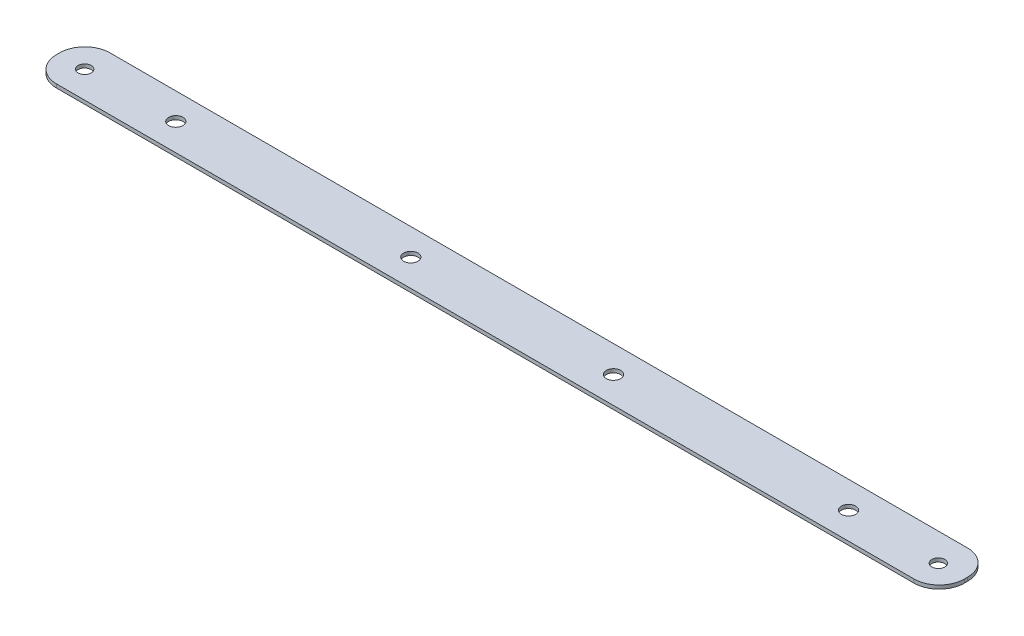
ISO-10303-21;
HEADER;
FILE_DESCRIPTION(('STEP AP214'),'2;1');
FILE_NAME('part.step','',(''),(''),'','','');
FILE_SCHEMA(('AUTOMOTIVE_DESIGN { 1 0 10303 214 1 1 1 1 }'));
ENDSEC;
DATA;
#1=APPLICATION_CONTEXT('core data for automotive mechanical design processes');
#2=APPLICATION_PROTOCOL_DEFINITION('international standard','automotive_design',2000,#1);
#3=PRODUCT_CONTEXT('',#1,'mechanical');
#4=PRODUCT('Part','Part','',(#3));
#5=PRODUCT_RELATED_PRODUCT_CATEGORY('part','',(#4));
#6=PRODUCT_DEFINITION_FORMATION('','',#4);
#7=PRODUCT_DEFINITION_CONTEXT('part definition',#1,'design');
#8=PRODUCT_DEFINITION('design','',#6,#7);
#9=PRODUCT_DEFINITION_SHAPE('','',#8);
#10=(LENGTH_UNIT() NAMED_UNIT(*) SI_UNIT(.MILLI.,.METRE.));
#11=(NAMED_UNIT(*) PLANE_ANGLE_UNIT() SI_UNIT($,.RADIAN.));
#12=(NAMED_UNIT(*) SI_UNIT($,.STERADIAN.) SOLID_ANGLE_UNIT());
#13=UNCERTAINTY_MEASURE_WITH_UNIT(LENGTH_MEASURE(1.E-05),#10,'distance_accuracy_value','');
#14=(GEOMETRIC_REPRESENTATION_CONTEXT(3) GLOBAL_UNCERTAINTY_ASSIGNED_CONTEXT((#13)) GLOBAL_UNIT_ASSIGNED_CONTEXT((#10,
#11,#12)) REPRESENTATION_CONTEXT('',''));
#15=CARTESIAN_POINT('',(0.,0.,0.));
#16=DIRECTION('',(0.,0.,1.));
#17=DIRECTION('',(1.,0.,0.));
#18=AXIS2_PLACEMENT_3D('',#15,#16,#17);
#19=CARTESIAN_POINT('',(-107.95,-0.86,6.37500000000002));
#20=DIRECTION('',(-1.,0.,0.));
#21=DIRECTION('',(0.,0.,1.));
#22=AXIS2_PLACEMENT_3D('',#19,#20,#21);
#23=PLANE('',#22);
#24=DIRECTION('',(0.,0.,1.));
#25=VECTOR('',#24,1.);
#26=CARTESIAN_POINT('',(-107.95,0.,6.37500000000002));
#27=LINE('',#26,#25);
#28=CARTESIAN_POINT('',(-107.95,0.,-0.374999999999985));
#29=VERTEX_POINT('',#28);
#30=CARTESIAN_POINT('',(-107.95,0.,0.375000000000012));
#31=VERTEX_POINT('',#30);
#32=EDGE_CURVE('E107',#29,#31,#27,.T.);
#33=ORIENTED_EDGE('',*,*,#32,.F.);
#34=DIRECTION('',(0.,1.,0.));
#35=VECTOR('',#34,1.);
#36=CARTESIAN_POINT('',(-107.95,-0.86,-0.374999999999985));
#37=LINE('',#36,#35);
#38=CARTESIAN_POINT('',(-107.95,-0.86,-0.374999999999985));
#39=VERTEX_POINT('',#38);
#40=EDGE_CURVE('E11',#29,#39,#37,.F.);
#41=ORIENTED_EDGE('',*,*,#40,.T.);
#42=DIRECTION('',(0.,0.,1.));
#43=VECTOR('',#42,1.);
#44=CARTESIAN_POINT('',(-107.95,-0.86,6.37500000000002));
#45=LINE('',#44,#43);
#46=CARTESIAN_POINT('',(-107.95,-0.86,0.375000000000012));
#47=VERTEX_POINT('',#46);
#48=EDGE_CURVE('E157',#39,#47,#45,.T.);
#49=ORIENTED_EDGE('',*,*,#48,.T.);
#50=DIRECTION('',(0.,1.,0.));
#51=VECTOR('',#50,1.);
#52=CARTESIAN_POINT('',(-107.95,-0.86,0.375000000000012));
#53=LINE('',#52,#51);
#54=EDGE_CURVE('E44',#47,#31,#53,.T.);
#55=ORIENTED_EDGE('',*,*,#54,.T.);
#56=EDGE_LOOP('',(#33,#41,#49,#55));
#57=FACE_BOUND('',#56,.T.);
#58=ADVANCED_FACE('F36',(#57),#23,.T.);
#59=CARTESIAN_POINT('',(107.95,-0.86,-6.37500000000001));
#60=DIRECTION('',(0.,0.,-1.));
#61=DIRECTION('',(-1.,0.,0.));
#62=AXIS2_PLACEMENT_3D('',#59,#60,#61);
#63=PLANE('',#62);
#64=DIRECTION('',(-1.,0.,0.));
#65=VECTOR('',#64,1.);
#66=CARTESIAN_POINT('',(107.95,0.,-6.37500000000001));
#67=LINE('',#66,#65);
#68=CARTESIAN_POINT('',(101.95,0.,-6.375));
#69=VERTEX_POINT('',#68);
#70=CARTESIAN_POINT('',(-101.95,0.,-6.37499999999998));
#71=VERTEX_POINT('',#70);
#72=EDGE_CURVE('E132',#69,#71,#67,.T.);
#73=ORIENTED_EDGE('',*,*,#72,.F.);
#74=DIRECTION('',(0.,1.,0.));
#75=VECTOR('',#74,1.);
#76=CARTESIAN_POINT('',(101.95,-0.86,-6.375));
#77=LINE('',#76,#75);
#78=CARTESIAN_POINT('',(101.95,-0.86,-6.375));
#79=VERTEX_POINT('',#78);
#80=EDGE_CURVE('E58',#69,#79,#77,.F.);
#81=ORIENTED_EDGE('',*,*,#80,.T.);
#82=DIRECTION('',(-1.,0.,0.));
#83=VECTOR('',#82,1.);
#84=CARTESIAN_POINT('',(107.95,-0.86,-6.37500000000001));
#85=LINE('',#84,#83);
#86=CARTESIAN_POINT('',(-101.95,-0.86,-6.37499999999998));
#87=VERTEX_POINT('',#86);
#88=EDGE_CURVE('E126',#79,#87,#85,.T.);
#89=ORIENTED_EDGE('',*,*,#88,.T.);
#90=DIRECTION('',(0.,1.,0.));
#91=VECTOR('',#90,1.);
#92=CARTESIAN_POINT('',(-101.95,-0.86,-6.37499999999998));
#93=LINE('',#92,#91);
#94=EDGE_CURVE('E151',#87,#71,#93,.T.);
#95=ORIENTED_EDGE('',*,*,#94,.T.);
#96=EDGE_LOOP('',(#73,#81,#89,#95));
#97=FACE_BOUND('',#96,.T.);
#98=ADVANCED_FACE('F194',(#97),#63,.T.);
#99=CARTESIAN_POINT('',(107.95,-0.86,6.37499999999999));
#100=DIRECTION('',(1.,0.,0.));
#101=DIRECTION('',(0.,0.,-1.));
#102=AXIS2_PLACEMENT_3D('',#99,#100,#101);
#103=PLANE('',#102);
#104=DIRECTION('',(0.,0.,-1.));
#105=VECTOR('',#104,1.);
#106=CARTESIAN_POINT('',(107.95,0.,6.37499999999999));
#107=LINE('',#106,#105);
#108=CARTESIAN_POINT('',(107.95,0.,0.374999999999993));
#109=VERTEX_POINT('',#108);
#110=CARTESIAN_POINT('',(107.95,0.,-0.375000000000005));
#111=VERTEX_POINT('',#110);
#112=EDGE_CURVE('E122',#109,#111,#107,.T.);
#113=ORIENTED_EDGE('',*,*,#112,.F.);
#114=DIRECTION('',(0.,1.,0.));
#115=VECTOR('',#114,1.);
#116=CARTESIAN_POINT('',(107.95,-0.86,0.374999999999993));
#117=LINE('',#116,#115);
#118=CARTESIAN_POINT('',(107.95,-0.86,0.374999999999993));
#119=VERTEX_POINT('',#118);
#120=EDGE_CURVE('E143',#109,#119,#117,.F.);
#121=ORIENTED_EDGE('',*,*,#120,.T.);
#122=DIRECTION('',(0.,0.,-1.));
#123=VECTOR('',#122,1.);
#124=CARTESIAN_POINT('',(107.95,-0.86,6.37499999999999));
#125=LINE('',#124,#123);
#126=CARTESIAN_POINT('',(107.95,-0.86,-0.375000000000005));
#127=VERTEX_POINT('',#126);
#128=EDGE_CURVE('E129',#119,#127,#125,.T.);
#129=ORIENTED_EDGE('',*,*,#128,.T.);
#130=DIRECTION('',(0.,1.,0.));
#131=VECTOR('',#130,1.);
#132=CARTESIAN_POINT('',(107.95,-0.86,-0.375000000000005));
#133=LINE('',#132,#131);
#134=EDGE_CURVE('E140',#127,#111,#133,.T.);
#135=ORIENTED_EDGE('',*,*,#134,.T.);
#136=EDGE_LOOP('',(#113,#121,#129,#135));
#137=FACE_BOUND('',#136,.T.);
#138=ADVANCED_FACE('F173',(#137),#103,.T.);
#139=CARTESIAN_POINT('',(107.95,-0.86,6.37499999999999));
#140=DIRECTION('',(0.,0.,1.));
#141=DIRECTION('',(1.,0.,0.));
#142=AXIS2_PLACEMENT_3D('',#139,#140,#141);
#143=PLANE('',#142);
#144=DIRECTION('',(1.,0.,0.));
#145=VECTOR('',#144,1.);
#146=CARTESIAN_POINT('',(107.95,-0.86,6.37499999999999));
#147=LINE('',#146,#145);
#148=CARTESIAN_POINT('',(-101.95,-0.86,6.37500000000002));
#149=VERTEX_POINT('',#148);
#150=CARTESIAN_POINT('',(101.95,-0.86,6.37499999999999));
#151=VERTEX_POINT('',#150);
#152=EDGE_CURVE('E158',#149,#151,#147,.T.);
#153=ORIENTED_EDGE('',*,*,#152,.T.);
#154=DIRECTION('',(0.,1.,0.));
#155=VECTOR('',#154,1.);
#156=CARTESIAN_POINT('',(101.95,-0.86,6.37499999999999));
#157=LINE('',#156,#155);
#158=CARTESIAN_POINT('',(101.95,0.,6.37499999999999));
#159=VERTEX_POINT('',#158);
#160=EDGE_CURVE('E113',#151,#159,#157,.T.);
#161=ORIENTED_EDGE('',*,*,#160,.T.);
#162=DIRECTION('',(1.,0.,0.));
#163=VECTOR('',#162,1.);
#164=CARTESIAN_POINT('',(107.95,0.,6.37499999999999));
#165=LINE('',#164,#163);
#166=CARTESIAN_POINT('',(-101.95,0.,6.37500000000002));
#167=VERTEX_POINT('',#166);
#168=EDGE_CURVE('E105',#167,#159,#165,.T.);
#169=ORIENTED_EDGE('',*,*,#168,.F.);
#170=DIRECTION('',(0.,1.,0.));
#171=VECTOR('',#170,1.);
#172=CARTESIAN_POINT('',(-101.95,-0.86,6.37500000000002));
#173=LINE('',#172,#171);
#174=EDGE_CURVE('E119',#167,#149,#173,.F.);
#175=ORIENTED_EDGE('',*,*,#174,.T.);
#176=EDGE_LOOP('',(#153,#161,#169,#175));
#177=FACE_BOUND('',#176,.T.);
#178=ADVANCED_FACE('F118',(#177),#143,.T.);
#179=CARTESIAN_POINT('',(0.,-0.86,0.));
#180=DIRECTION('',(0.,1.,0.));
#181=DIRECTION('',(0.,0.,1.));
#182=AXIS2_PLACEMENT_3D('',#179,#180,#181);
#183=PLANE('',#182);
#184=CARTESIAN_POINT('',(101.601385272546,-0.86,0.242368773103314));
#185=DIRECTION('',(0.,1.,0.));
#186=DIRECTION('',(0.,0.,1.));
#187=AXIS2_PLACEMENT_3D('',#184,#185,#186);
#188=CIRCLE('',#187,1.54999999999999);
#189=CARTESIAN_POINT('',(101.601385272546,-0.86,1.79236877310331));
#190=VERTEX_POINT('',#189);
#191=EDGE_CURVE('E241',#190,#190,#188,.T.);
#192=ORIENTED_EDGE('',*,*,#191,.T.);
#193=EDGE_LOOP('',(#192));
#194=FACE_BOUND('',#193,.T.);
#195=CARTESIAN_POINT('',(-80.0116084127714,-0.86,-0.0752075406612852));
#196=DIRECTION('',(0.,1.,0.));
#197=DIRECTION('',(0.,0.,1.));
#198=AXIS2_PLACEMENT_3D('',#195,#196,#197);
#199=CIRCLE('',#198,1.69999999999999);
#200=CARTESIAN_POINT('',(-80.0116084127714,-0.86,1.62479245933871));
#201=VERTEX_POINT('',#200);
#202=EDGE_CURVE('E245',#201,#201,#199,.T.);
#203=ORIENTED_EDGE('',*,*,#202,.T.);
#204=EDGE_LOOP('',(#203));
#205=FACE_BOUND('',#204,.T.);
#206=CARTESIAN_POINT('',(-24.1316084127714,-0.86,-0.0752075406612853));
#207=DIRECTION('',(0.,1.,0.));
#208=DIRECTION('',(0.,0.,1.));
#209=AXIS2_PLACEMENT_3D('',#206,#207,#208);
#210=CIRCLE('',#209,1.69999999999999);
#211=CARTESIAN_POINT('',(-24.1316084127714,-0.86,1.6247924593387));
#212=VERTEX_POINT('',#211);
#213=EDGE_CURVE('E254',#212,#212,#210,.T.);
#214=ORIENTED_EDGE('',*,*,#213,.T.);
#215=EDGE_LOOP('',(#214));
#216=FACE_BOUND('',#215,.T.);
#217=CARTESIAN_POINT('',(80.01,-0.86,0.));
#218=DIRECTION('',(0.,1.,0.));
#219=DIRECTION('',(0.,0.,1.));
#220=AXIS2_PLACEMENT_3D('',#217,#218,#219);
#221=CIRCLE('',#220,1.69999999999999);
#222=CARTESIAN_POINT('',(80.01,-0.86,1.69999999999999));
#223=VERTEX_POINT('',#222);
#224=EDGE_CURVE('E260',#223,#223,#221,.T.);
#225=ORIENTED_EDGE('',*,*,#224,.T.);
#226=EDGE_LOOP('',(#225));
#227=FACE_BOUND('',#226,.T.);
#228=CARTESIAN_POINT('',(24.13,-0.86,0.));
#229=DIRECTION('',(0.,1.,0.));
#230=DIRECTION('',(0.,0.,1.));
#231=AXIS2_PLACEMENT_3D('',#228,#229,#230);
#232=CIRCLE('',#231,1.69999999999999);
#233=CARTESIAN_POINT('',(24.13,-0.86,1.69999999999999));
#234=VERTEX_POINT('',#233);
#235=EDGE_CURVE('E266',#234,#234,#232,.T.);
#236=ORIENTED_EDGE('',*,*,#235,.T.);
#237=EDGE_LOOP('',(#236));
#238=FACE_BOUND('',#237,.T.);
#239=CARTESIAN_POINT('',(-101.6,-0.86,0.));
#240=DIRECTION('',(0.,1.,0.));
#241=DIRECTION('',(0.,0.,1.));
#242=AXIS2_PLACEMENT_3D('',#239,#240,#241);
#243=CIRCLE('',#242,1.54999999999999);
#244=CARTESIAN_POINT('',(-101.6,-0.86,1.54999999999999));
#245=VERTEX_POINT('',#244);
#246=EDGE_CURVE('E168',#245,#245,#243,.T.);
#247=ORIENTED_EDGE('',*,*,#246,.T.);
#248=EDGE_LOOP('',(#247));
#249=FACE_BOUND('',#248,.T.);
#250=ORIENTED_EDGE('',*,*,#128,.F.);
#251=CARTESIAN_POINT('',(101.95,-0.86,0.374999999999992));
#252=DIRECTION('',(0.,1.,0.));
#253=DIRECTION('',(0.,0.,1.));
#254=AXIS2_PLACEMENT_3D('',#251,#252,#253);
#255=CIRCLE('',#254,6.);
#256=EDGE_CURVE('E149',#119,#151,#255,.F.);
#257=ORIENTED_EDGE('',*,*,#256,.T.);
#258=ORIENTED_EDGE('',*,*,#152,.F.);
#259=CARTESIAN_POINT('',(-101.95,-0.86,0.375000000000019));
#260=DIRECTION('',(0.,1.,0.));
#261=DIRECTION('',(0.,0.,1.));
#262=AXIS2_PLACEMENT_3D('',#259,#260,#261);
#263=CIRCLE('',#262,6.);
#264=EDGE_CURVE('E125',#149,#47,#263,.F.);
#265=ORIENTED_EDGE('',*,*,#264,.T.);
#266=ORIENTED_EDGE('',*,*,#48,.F.);
#267=CARTESIAN_POINT('',(-101.95,-0.86,-0.374999999999979));
#268=DIRECTION('',(0.,1.,0.));
#269=DIRECTION('',(0.,0.,1.));
#270=AXIS2_PLACEMENT_3D('',#267,#268,#269);
#271=CIRCLE('',#270,6.);
#272=EDGE_CURVE('E51',#39,#87,#271,.F.);
#273=ORIENTED_EDGE('',*,*,#272,.T.);
#274=ORIENTED_EDGE('',*,*,#88,.F.);
#275=CARTESIAN_POINT('',(101.95,-0.86,-0.375000000000005));
#276=DIRECTION('',(0.,1.,0.));
#277=DIRECTION('',(0.,0.,1.));
#278=AXIS2_PLACEMENT_3D('',#275,#276,#277);
#279=CIRCLE('',#278,6.);
#280=EDGE_CURVE('E147',#79,#127,#279,.F.);
#281=ORIENTED_EDGE('',*,*,#280,.T.);
#282=EDGE_LOOP('',(#250,#257,#258,#265,#266,#273,#274,#281));
#283=FACE_BOUND('',#282,.T.);
#284=ADVANCED_FACE('F179',(#194,#205,#216,#227,#238,#249,#283),#183,.F.);
#285=CARTESIAN_POINT('',(0.,0.,0.));
#286=DIRECTION('',(0.,1.,0.));
#287=DIRECTION('',(0.,0.,1.));
#288=AXIS2_PLACEMENT_3D('',#285,#286,#287);
#289=PLANE('',#288);
#290=CARTESIAN_POINT('',(101.601385272546,0.,0.242368773103314));
#291=DIRECTION('',(0.,1.,0.));
#292=DIRECTION('',(0.,0.,1.));
#293=AXIS2_PLACEMENT_3D('',#290,#291,#292);
#294=CIRCLE('',#293,1.54999999999999);
#295=CARTESIAN_POINT('',(101.601385272546,0.,1.79236877310331));
#296=VERTEX_POINT('',#295);
#297=EDGE_CURVE('E238',#296,#296,#294,.T.);
#298=ORIENTED_EDGE('',*,*,#297,.F.);
#299=EDGE_LOOP('',(#298));
#300=FACE_BOUND('',#299,.T.);
#301=CARTESIAN_POINT('',(-80.0116084127714,0.,-0.0752075406612852));
#302=DIRECTION('',(0.,1.,0.));
#303=DIRECTION('',(0.,0.,1.));
#304=AXIS2_PLACEMENT_3D('',#301,#302,#303);
#305=CIRCLE('',#304,1.69999999999999);
#306=CARTESIAN_POINT('',(-80.0116084127714,0.,1.62479245933871));
#307=VERTEX_POINT('',#306);
#308=EDGE_CURVE('E242',#307,#307,#305,.T.);
#309=ORIENTED_EDGE('',*,*,#308,.F.);
#310=EDGE_LOOP('',(#309));
#311=FACE_BOUND('',#310,.T.);
#312=CARTESIAN_POINT('',(-24.1316084127714,0.,-0.0752075406612853));
#313=DIRECTION('',(0.,1.,0.));
#314=DIRECTION('',(0.,0.,1.));
#315=AXIS2_PLACEMENT_3D('',#312,#313,#314);
#316=CIRCLE('',#315,1.69999999999999);
#317=CARTESIAN_POINT('',(-24.1316084127714,0.,1.6247924593387));
#318=VERTEX_POINT('',#317);
#319=EDGE_CURVE('E251',#318,#318,#316,.T.);
#320=ORIENTED_EDGE('',*,*,#319,.F.);
#321=EDGE_LOOP('',(#320));
#322=FACE_BOUND('',#321,.T.);
#323=CARTESIAN_POINT('',(80.01,0.,0.));
#324=DIRECTION('',(0.,1.,0.));
#325=DIRECTION('',(0.,0.,1.));
#326=AXIS2_PLACEMENT_3D('',#323,#324,#325);
#327=CIRCLE('',#326,1.69999999999999);
#328=CARTESIAN_POINT('',(80.01,0.,1.69999999999999));
#329=VERTEX_POINT('',#328);
#330=EDGE_CURVE('E257',#329,#329,#327,.T.);
#331=ORIENTED_EDGE('',*,*,#330,.F.);
#332=EDGE_LOOP('',(#331));
#333=FACE_BOUND('',#332,.T.);
#334=CARTESIAN_POINT('',(24.13,0.,0.));
#335=DIRECTION('',(0.,1.,0.));
#336=DIRECTION('',(0.,0.,1.));
#337=AXIS2_PLACEMENT_3D('',#334,#335,#336);
#338=CIRCLE('',#337,1.69999999999999);
#339=CARTESIAN_POINT('',(24.13,0.,1.69999999999999));
#340=VERTEX_POINT('',#339);
#341=EDGE_CURVE('E263',#340,#340,#338,.T.);
#342=ORIENTED_EDGE('',*,*,#341,.F.);
#343=EDGE_LOOP('',(#342));
#344=FACE_BOUND('',#343,.T.);
#345=CARTESIAN_POINT('',(-101.6,0.,0.));
#346=DIRECTION('',(0.,1.,0.));
#347=DIRECTION('',(0.,0.,1.));
#348=AXIS2_PLACEMENT_3D('',#345,#346,#347);
#349=CIRCLE('',#348,1.54999999999999);
#350=CARTESIAN_POINT('',(-101.6,0.,1.54999999999999));
#351=VERTEX_POINT('',#350);
#352=EDGE_CURVE('E163',#351,#351,#349,.T.);
#353=ORIENTED_EDGE('',*,*,#352,.F.);
#354=EDGE_LOOP('',(#353));
#355=FACE_BOUND('',#354,.T.);
#356=ORIENTED_EDGE('',*,*,#168,.T.);
#357=CARTESIAN_POINT('',(101.95,0.,0.374999999999992));
#358=DIRECTION('',(0.,1.,0.));
#359=DIRECTION('',(0.,0.,1.));
#360=AXIS2_PLACEMENT_3D('',#357,#358,#359);
#361=CIRCLE('',#360,6.);
#362=EDGE_CURVE('E138',#159,#109,#361,.T.);
#363=ORIENTED_EDGE('',*,*,#362,.T.);
#364=ORIENTED_EDGE('',*,*,#112,.T.);
#365=CARTESIAN_POINT('',(101.95,0.,-0.375000000000005));
#366=DIRECTION('',(0.,1.,0.));
#367=DIRECTION('',(0.,0.,1.));
#368=AXIS2_PLACEMENT_3D('',#365,#366,#367);
#369=CIRCLE('',#368,6.);
#370=EDGE_CURVE('E136',#111,#69,#369,.T.);
#371=ORIENTED_EDGE('',*,*,#370,.T.);
#372=ORIENTED_EDGE('',*,*,#72,.T.);
#373=CARTESIAN_POINT('',(-101.95,0.,-0.374999999999979));
#374=DIRECTION('',(0.,1.,0.));
#375=DIRECTION('',(0.,0.,1.));
#376=AXIS2_PLACEMENT_3D('',#373,#374,#375);
#377=CIRCLE('',#376,6.);
#378=EDGE_CURVE('E112',#71,#29,#377,.T.);
#379=ORIENTED_EDGE('',*,*,#378,.T.);
#380=ORIENTED_EDGE('',*,*,#32,.T.);
#381=CARTESIAN_POINT('',(-101.95,0.,0.375000000000019));
#382=DIRECTION('',(0.,1.,0.));
#383=DIRECTION('',(0.,0.,1.));
#384=AXIS2_PLACEMENT_3D('',#381,#382,#383);
#385=CIRCLE('',#384,6.);
#386=EDGE_CURVE('E102',#31,#167,#385,.T.);
#387=ORIENTED_EDGE('',*,*,#386,.T.);
#388=EDGE_LOOP('',(#356,#363,#364,#371,#372,#379,#380,#387));
#389=FACE_BOUND('',#388,.T.);
#390=ADVANCED_FACE('F104',(#300,#311,#322,#333,#344,#355,#389),#289,.T.);
#391=CARTESIAN_POINT('',(-101.6,-0.86,0.));
#392=DIRECTION('',(0.,1.,0.));
#393=DIRECTION('',(0.,0.,1.));
#394=AXIS2_PLACEMENT_3D('',#391,#392,#393);
#395=CYLINDRICAL_SURFACE('',#394,1.54999999999999);
#396=ORIENTED_EDGE('',*,*,#246,.F.);
#397=EDGE_LOOP('',(#396));
#398=FACE_BOUND('',#397,.T.);
#399=ORIENTED_EDGE('',*,*,#352,.T.);
#400=EDGE_LOOP('',(#399));
#401=FACE_BOUND('',#400,.T.);
#402=ADVANCED_FACE('F191',(#398,#401),#395,.F.);
#403=CARTESIAN_POINT('',(101.95,-0.86,0.374999999999992));
#404=DIRECTION('',(0.,1.,0.));
#405=DIRECTION('',(0.,0.,1.));
#406=AXIS2_PLACEMENT_3D('',#403,#404,#405);
#407=CYLINDRICAL_SURFACE('',#406,6.);
#408=ORIENTED_EDGE('',*,*,#256,.F.);
#409=ORIENTED_EDGE('',*,*,#120,.F.);
#410=ORIENTED_EDGE('',*,*,#362,.F.);
#411=ORIENTED_EDGE('',*,*,#160,.F.);
#412=EDGE_LOOP('',(#408,#409,#410,#411));
#413=FACE_BOUND('',#412,.T.);
#414=ADVANCED_FACE('F178',(#413),#407,.T.);
#415=CARTESIAN_POINT('',(101.95,-0.86,-0.375000000000005));
#416=DIRECTION('',(0.,1.,0.));
#417=DIRECTION('',(0.,0.,1.));
#418=AXIS2_PLACEMENT_3D('',#415,#416,#417);
#419=CYLINDRICAL_SURFACE('',#418,6.);
#420=ORIENTED_EDGE('',*,*,#280,.F.);
#421=ORIENTED_EDGE('',*,*,#80,.F.);
#422=ORIENTED_EDGE('',*,*,#370,.F.);
#423=ORIENTED_EDGE('',*,*,#134,.F.);
#424=EDGE_LOOP('',(#420,#421,#422,#423));
#425=FACE_BOUND('',#424,.T.);
#426=ADVANCED_FACE('F182',(#425),#419,.T.);
#427=CARTESIAN_POINT('',(-101.95,-0.86,-0.374999999999979));
#428=DIRECTION('',(0.,1.,0.));
#429=DIRECTION('',(0.,0.,1.));
#430=AXIS2_PLACEMENT_3D('',#427,#428,#429);
#431=CYLINDRICAL_SURFACE('',#430,6.);
#432=ORIENTED_EDGE('',*,*,#272,.F.);
#433=ORIENTED_EDGE('',*,*,#40,.F.);
#434=ORIENTED_EDGE('',*,*,#378,.F.);
#435=ORIENTED_EDGE('',*,*,#94,.F.);
#436=EDGE_LOOP('',(#432,#433,#434,#435));
#437=FACE_BOUND('',#436,.T.);
#438=ADVANCED_FACE('F184',(#437),#431,.T.);
#439=CARTESIAN_POINT('',(-101.95,-0.86,0.375000000000019));
#440=DIRECTION('',(0.,1.,0.));
#441=DIRECTION('',(0.,0.,1.));
#442=AXIS2_PLACEMENT_3D('',#439,#440,#441);
#443=CYLINDRICAL_SURFACE('',#442,6.);
#444=ORIENTED_EDGE('',*,*,#264,.F.);
#445=ORIENTED_EDGE('',*,*,#174,.F.);
#446=ORIENTED_EDGE('',*,*,#386,.F.);
#447=ORIENTED_EDGE('',*,*,#54,.F.);
#448=EDGE_LOOP('',(#444,#445,#446,#447));
#449=FACE_BOUND('',#448,.T.);
#450=ADVANCED_FACE('F38',(#449),#443,.T.);
#451=CARTESIAN_POINT('',(24.13,0.,0.));
#452=DIRECTION('',(0.,1.,0.));
#453=DIRECTION('',(0.,0.,1.));
#454=AXIS2_PLACEMENT_3D('',#451,#452,#453);
#455=CYLINDRICAL_SURFACE('',#454,1.69999999999999);
#456=ORIENTED_EDGE('',*,*,#341,.T.);
#457=EDGE_LOOP('',(#456));
#458=FACE_BOUND('',#457,.T.);
#459=ORIENTED_EDGE('',*,*,#235,.F.);
#460=EDGE_LOOP('',(#459));
#461=FACE_BOUND('',#460,.T.);
#462=ADVANCED_FACE('F214',(#458,#461),#455,.F.);
#463=CARTESIAN_POINT('',(80.01,0.,0.));
#464=DIRECTION('',(0.,1.,0.));
#465=DIRECTION('',(0.,0.,1.));
#466=AXIS2_PLACEMENT_3D('',#463,#464,#465);
#467=CYLINDRICAL_SURFACE('',#466,1.69999999999999);
#468=ORIENTED_EDGE('',*,*,#330,.T.);
#469=EDGE_LOOP('',(#468));
#470=FACE_BOUND('',#469,.T.);
#471=ORIENTED_EDGE('',*,*,#224,.F.);
#472=EDGE_LOOP('',(#471));
#473=FACE_BOUND('',#472,.T.);
#474=ADVANCED_FACE('F217',(#470,#473),#467,.F.);
#475=CARTESIAN_POINT('',(-24.1316084127714,0.,-0.0752075406612853));
#476=DIRECTION('',(0.,1.,0.));
#477=DIRECTION('',(0.,0.,1.));
#478=AXIS2_PLACEMENT_3D('',#475,#476,#477);
#479=CYLINDRICAL_SURFACE('',#478,1.69999999999999);
#480=ORIENTED_EDGE('',*,*,#319,.T.);
#481=EDGE_LOOP('',(#480));
#482=FACE_BOUND('',#481,.T.);
#483=ORIENTED_EDGE('',*,*,#213,.F.);
#484=EDGE_LOOP('',(#483));
#485=FACE_BOUND('',#484,.T.);
#486=ADVANCED_FACE('F221',(#482,#485),#479,.F.);
#487=CARTESIAN_POINT('',(-80.0116084127714,0.,-0.0752075406612852));
#488=DIRECTION('',(0.,1.,0.));
#489=DIRECTION('',(0.,0.,1.));
#490=AXIS2_PLACEMENT_3D('',#487,#488,#489);
#491=CYLINDRICAL_SURFACE('',#490,1.69999999999999);
#492=ORIENTED_EDGE('',*,*,#308,.T.);
#493=EDGE_LOOP('',(#492));
#494=FACE_BOUND('',#493,.T.);
#495=ORIENTED_EDGE('',*,*,#202,.F.);
#496=EDGE_LOOP('',(#495));
#497=FACE_BOUND('',#496,.T.);
#498=ADVANCED_FACE('F225',(#494,#497),#491,.F.);
#499=CARTESIAN_POINT('',(101.601385272546,-82.,0.242368773103314));
#500=DIRECTION('',(0.,1.,0.));
#501=DIRECTION('',(0.,0.,1.));
#502=AXIS2_PLACEMENT_3D('',#499,#500,#501);
#503=CYLINDRICAL_SURFACE('',#502,1.54999999999999);
#504=ORIENTED_EDGE('',*,*,#297,.T.);
#505=EDGE_LOOP('',(#504));
#506=FACE_BOUND('',#505,.T.);
#507=ORIENTED_EDGE('',*,*,#191,.F.);
#508=EDGE_LOOP('',(#507));
#509=FACE_BOUND('',#508,.T.);
#510=ADVANCED_FACE('F229',(#506,#509),#503,.F.);
#511=CLOSED_SHELL('',(#58,#98,#138,#178,#284,#390,#402,#414,#426,#438,#450,#462,#474,#486,#498,#510));
#512=MANIFOLD_SOLID_BREP('B2',#511);
#513=ADVANCED_BREP_SHAPE_REPRESENTATION('',(#18,#512),#14);
#514=SHAPE_DEFINITION_REPRESENTATION(#9,#513);
ENDSEC;
END-ISO-10303-21;
